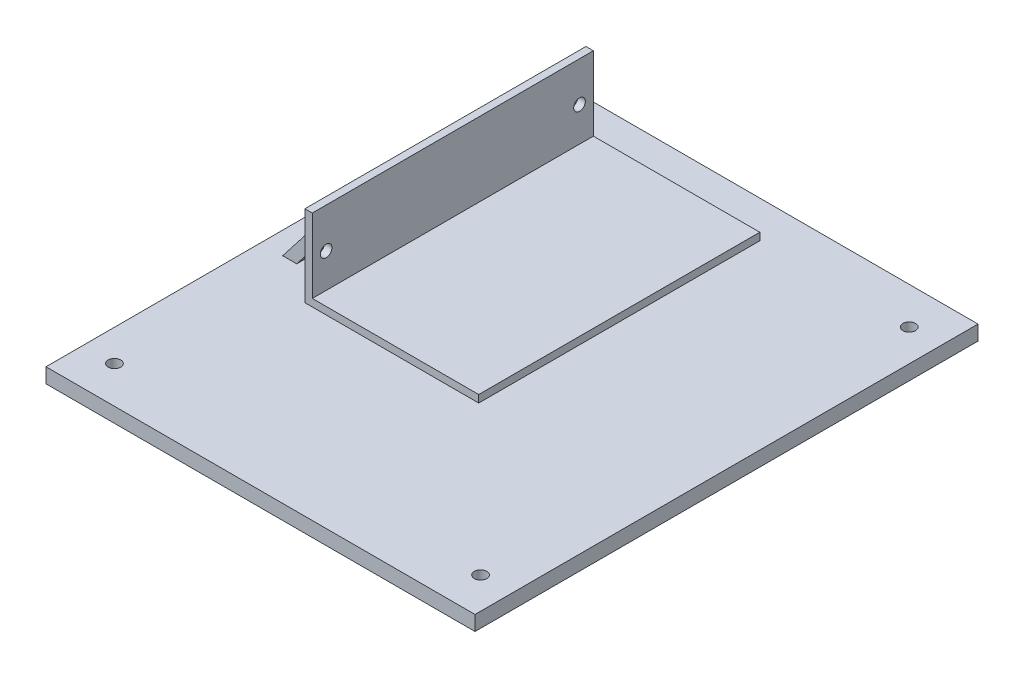
ISO-10303-21;
HEADER;
FILE_DESCRIPTION(('STEP AP214'),'2;1');
FILE_NAME('part.step','',(''),(''),'','','');
FILE_SCHEMA(('AUTOMOTIVE_DESIGN { 1 0 10303 214 1 1 1 1 }'));
ENDSEC;
DATA;
#1=APPLICATION_CONTEXT('core data for automotive mechanical design processes');
#2=APPLICATION_PROTOCOL_DEFINITION('international standard','automotive_design',2000,#1);
#3=PRODUCT_CONTEXT('',#1,'mechanical');
#4=PRODUCT('Part','Part','',(#3));
#5=PRODUCT_RELATED_PRODUCT_CATEGORY('part','',(#4));
#6=PRODUCT_DEFINITION_FORMATION('','',#4);
#7=PRODUCT_DEFINITION_CONTEXT('part definition',#1,'design');
#8=PRODUCT_DEFINITION('design','',#6,#7);
#9=PRODUCT_DEFINITION_SHAPE('','',#8);
#10=(LENGTH_UNIT() NAMED_UNIT(*) SI_UNIT(.MILLI.,.METRE.));
#11=(NAMED_UNIT(*) PLANE_ANGLE_UNIT() SI_UNIT($,.RADIAN.));
#12=(NAMED_UNIT(*) SI_UNIT($,.STERADIAN.) SOLID_ANGLE_UNIT());
#13=UNCERTAINTY_MEASURE_WITH_UNIT(LENGTH_MEASURE(1.E-05),#10,'distance_accuracy_value','');
#14=(GEOMETRIC_REPRESENTATION_CONTEXT(3) GLOBAL_UNCERTAINTY_ASSIGNED_CONTEXT((#13)) GLOBAL_UNIT_ASSIGNED_CONTEXT((#10,
#11,#12)) REPRESENTATION_CONTEXT('',''));
#15=CARTESIAN_POINT('',(0.,0.,0.));
#16=DIRECTION('',(0.,0.,1.));
#17=DIRECTION('',(1.,0.,0.));
#18=AXIS2_PLACEMENT_3D('',#15,#16,#17);
#19=CARTESIAN_POINT('',(-73.66,2.54,172.72));
#20=DIRECTION('',(0.,-1.,0.));
#21=DIRECTION('',(0.,0.,-1.));
#22=AXIS2_PLACEMENT_3D('',#19,#20,#21);
#23=PLANE('',#22);
#24=CARTESIAN_POINT('',(-62.738,2.54,12.7));
#25=DIRECTION('',(0.,1.,0.));
#26=DIRECTION('',(0.,0.,1.));
#27=AXIS2_PLACEMENT_3D('',#24,#25,#26);
#28=CIRCLE('',#27,2.159);
#29=CARTESIAN_POINT('',(-62.738,2.54,14.859));
#30=VERTEX_POINT('',#29);
#31=EDGE_CURVE('E230',#30,#30,#28,.T.);
#32=ORIENTED_EDGE('',*,*,#31,.F.);
#33=EDGE_LOOP('',(#32));
#34=FACE_BOUND('',#33,.T.);
#35=DIRECTION('',(-1.,0.,0.));
#36=VECTOR('',#35,1.);
#37=CARTESIAN_POINT('',(-73.66,2.54,0.));
#38=LINE('',#37,#36);
#39=CARTESIAN_POINT('',(73.66,2.54,0.));
#40=VERTEX_POINT('',#39);
#41=CARTESIAN_POINT('',(-73.66,2.54,0.));
#42=VERTEX_POINT('',#41);
#43=EDGE_CURVE('E254',#40,#42,#38,.T.);
#44=ORIENTED_EDGE('',*,*,#43,.T.);
#45=DIRECTION('',(0.,0.,-1.));
#46=VECTOR('',#45,1.);
#47=CARTESIAN_POINT('',(-73.66,2.54,172.72));
#48=LINE('',#47,#46);
#49=CARTESIAN_POINT('',(-73.66,2.54,172.72));
#50=VERTEX_POINT('',#49);
#51=EDGE_CURVE('E48',#50,#42,#48,.T.);
#52=ORIENTED_EDGE('',*,*,#51,.F.);
#53=DIRECTION('',(-1.,0.,0.));
#54=VECTOR('',#53,1.);
#55=CARTESIAN_POINT('',(-73.66,2.54,172.72));
#56=LINE('',#55,#54);
#57=CARTESIAN_POINT('',(73.66,2.54,172.72));
#58=VERTEX_POINT('',#57);
#59=EDGE_CURVE('E244',#58,#50,#56,.T.);
#60=ORIENTED_EDGE('',*,*,#59,.F.);
#61=DIRECTION('',(0.,0.,-1.));
#62=VECTOR('',#61,1.);
#63=CARTESIAN_POINT('',(73.66,2.54,172.72));
#64=LINE('',#63,#62);
#65=EDGE_CURVE('E11',#58,#40,#64,.T.);
#66=ORIENTED_EDGE('',*,*,#65,.T.);
#67=EDGE_LOOP('',(#44,#52,#60,#66));
#68=FACE_BOUND('',#67,.T.);
#69=DIRECTION('',(0.,0.,1.));
#70=VECTOR('',#69,1.);
#71=CARTESIAN_POINT('',(-48.26,2.54,12.7));
#72=LINE('',#71,#70);
#73=CARTESIAN_POINT('',(-48.26,2.54,12.7));
#74=VERTEX_POINT('',#73);
#75=CARTESIAN_POINT('',(-48.26,2.54,109.22));
#76=VERTEX_POINT('',#75);
#77=EDGE_CURVE('E188',#74,#76,#72,.T.);
#78=ORIENTED_EDGE('',*,*,#77,.F.);
#79=DIRECTION('',(-1.,0.,0.));
#80=VECTOR('',#79,1.);
#81=CARTESIAN_POINT('',(-48.26,2.54,12.7));
#82=LINE('',#81,#80);
#83=CARTESIAN_POINT('',(11.43,2.54,12.7));
#84=VERTEX_POINT('',#83);
#85=EDGE_CURVE('E192',#84,#74,#82,.T.);
#86=ORIENTED_EDGE('',*,*,#85,.F.);
#87=DIRECTION('',(0.,0.,-1.));
#88=VECTOR('',#87,1.);
#89=CARTESIAN_POINT('',(11.43,2.54,12.7));
#90=LINE('',#89,#88);
#91=CARTESIAN_POINT('',(11.43,2.54,109.22));
#92=VERTEX_POINT('',#91);
#93=EDGE_CURVE('E201',#92,#84,#90,.T.);
#94=ORIENTED_EDGE('',*,*,#93,.F.);
#95=DIRECTION('',(1.,0.,0.));
#96=VECTOR('',#95,1.);
#97=CARTESIAN_POINT('',(-48.26,2.54,109.22));
#98=LINE('',#97,#96);
#99=EDGE_CURVE('E198',#76,#92,#98,.T.);
#100=ORIENTED_EDGE('',*,*,#99,.F.);
#101=EDGE_LOOP('',(#78,#86,#94,#100));
#102=FACE_BOUND('',#101,.T.);
#103=CARTESIAN_POINT('',(62.865,2.54,160.02));
#104=DIRECTION('',(0.,1.,0.));
#105=DIRECTION('',(0.,0.,1.));
#106=AXIS2_PLACEMENT_3D('',#103,#104,#105);
#107=CIRCLE('',#106,2.15899999999999);
#108=CARTESIAN_POINT('',(62.865,2.54,162.179));
#109=VERTEX_POINT('',#108);
#110=EDGE_CURVE('E224',#109,#109,#107,.T.);
#111=ORIENTED_EDGE('',*,*,#110,.F.);
#112=EDGE_LOOP('',(#111));
#113=FACE_BOUND('',#112,.T.);
#114=CARTESIAN_POINT('',(-62.865,2.54,160.02));
#115=DIRECTION('',(0.,1.,0.));
#116=DIRECTION('',(0.,0.,1.));
#117=AXIS2_PLACEMENT_3D('',#114,#115,#116);
#118=CIRCLE('',#117,2.15899999999999);
#119=CARTESIAN_POINT('',(-62.865,2.54,162.179));
#120=VERTEX_POINT('',#119);
#121=EDGE_CURVE('E217',#120,#120,#118,.T.);
#122=ORIENTED_EDGE('',*,*,#121,.F.);
#123=EDGE_LOOP('',(#122));
#124=FACE_BOUND('',#123,.T.);
#125=CARTESIAN_POINT('',(62.738,2.54,12.7));
#126=DIRECTION('',(0.,1.,0.));
#127=DIRECTION('',(0.,0.,1.));
#128=AXIS2_PLACEMENT_3D('',#125,#126,#127);
#129=CIRCLE('',#128,2.15899999999999);
#130=CARTESIAN_POINT('',(62.738,2.54,14.859));
#131=VERTEX_POINT('',#130);
#132=EDGE_CURVE('E220',#131,#131,#129,.T.);
#133=ORIENTED_EDGE('',*,*,#132,.F.);
#134=EDGE_LOOP('',(#133));
#135=FACE_BOUND('',#134,.T.);
#136=DIRECTION('',(1.,0.,0.));
#137=VECTOR('',#136,1.);
#138=CARTESIAN_POINT('',(-66.04,2.54,22.86));
#139=LINE('',#138,#137);
#140=CARTESIAN_POINT('',(-66.04,2.54,22.86));
#141=VERTEX_POINT('',#140);
#142=CARTESIAN_POINT('',(-61.2132573670803,2.54,22.86));
#143=VERTEX_POINT('',#142);
#144=EDGE_CURVE('E147',#141,#143,#139,.T.);
#145=ORIENTED_EDGE('',*,*,#144,.T.);
#146=DIRECTION('',(0.,0.,1.));
#147=VECTOR('',#146,1.);
#148=CARTESIAN_POINT('',(-61.2132573670803,2.54,0.));
#149=LINE('',#148,#147);
#150=CARTESIAN_POINT('',(-61.2132573670803,2.54,99.06));
#151=VERTEX_POINT('',#150);
#152=EDGE_CURVE('E142',#143,#151,#149,.T.);
#153=ORIENTED_EDGE('',*,*,#152,.T.);
#154=DIRECTION('',(1.,0.,0.));
#155=VECTOR('',#154,1.);
#156=CARTESIAN_POINT('',(-66.04,2.54,99.06));
#157=LINE('',#156,#155);
#158=CARTESIAN_POINT('',(-66.04,2.54,99.06));
#159=VERTEX_POINT('',#158);
#160=EDGE_CURVE('E145',#159,#151,#157,.T.);
#161=ORIENTED_EDGE('',*,*,#160,.F.);
#162=DIRECTION('',(0.,0.,1.));
#163=VECTOR('',#162,1.);
#164=CARTESIAN_POINT('',(-66.04,2.54,22.86));
#165=LINE('',#164,#163);
#166=EDGE_CURVE('E161',#141,#159,#165,.T.);
#167=ORIENTED_EDGE('',*,*,#166,.F.);
#168=EDGE_LOOP('',(#145,#153,#161,#167));
#169=FACE_BOUND('',#168,.T.);
#170=ADVANCED_FACE('F40',(#34,#68,#102,#113,#124,#135,#169),#23,.F.);
#171=CARTESIAN_POINT('',(-48.26,5.08,12.7));
#172=DIRECTION('',(1.,0.,0.));
#173=DIRECTION('',(0.,0.,-1.));
#174=AXIS2_PLACEMENT_3D('',#171,#172,#173);
#175=PLANE('',#174);
#176=CARTESIAN_POINT('',(-48.26,16.83,104.46));
#177=DIRECTION('',(1.,0.,0.));
#178=DIRECTION('',(0.,0.,-1.));
#179=AXIS2_PLACEMENT_3D('',#176,#177,#178);
#180=CIRCLE('',#179,2.);
#181=CARTESIAN_POINT('',(-48.26,16.83,102.46));
#182=VERTEX_POINT('',#181);
#183=EDGE_CURVE('E150',#182,#182,#180,.T.);
#184=ORIENTED_EDGE('',*,*,#183,.T.);
#185=EDGE_LOOP('',(#184));
#186=FACE_BOUND('',#185,.T.);
#187=CARTESIAN_POINT('',(-48.26,16.83,17.46));
#188=DIRECTION('',(1.,0.,0.));
#189=DIRECTION('',(0.,0.,-1.));
#190=AXIS2_PLACEMENT_3D('',#187,#188,#189);
#191=CIRCLE('',#190,2.);
#192=CARTESIAN_POINT('',(-48.26,16.83,15.46));
#193=VERTEX_POINT('',#192);
#194=EDGE_CURVE('E418',#193,#193,#191,.T.);
#195=ORIENTED_EDGE('',*,*,#194,.T.);
#196=EDGE_LOOP('',(#195));
#197=FACE_BOUND('',#196,.T.);
#198=DIRECTION('',(0.,0.,1.));
#199=VECTOR('',#198,1.);
#200=CARTESIAN_POINT('',(-48.26,19.194188043389,0.));
#201=LINE('',#200,#199);
#202=CARTESIAN_POINT('',(-48.26,19.194188043389,22.86));
#203=VERTEX_POINT('',#202);
#204=CARTESIAN_POINT('',(-48.26,19.194188043389,99.06));
#205=VERTEX_POINT('',#204);
#206=EDGE_CURVE('E55',#203,#205,#201,.T.);
#207=ORIENTED_EDGE('',*,*,#206,.F.);
#208=DIRECTION('',(0.,-1.,0.));
#209=VECTOR('',#208,1.);
#210=CARTESIAN_POINT('',(-48.26,2.54,22.86));
#211=LINE('',#210,#209);
#212=CARTESIAN_POINT('',(-48.26,25.4,22.86));
#213=VERTEX_POINT('',#212);
#214=EDGE_CURVE('E428',#213,#203,#211,.T.);
#215=ORIENTED_EDGE('',*,*,#214,.F.);
#216=DIRECTION('',(0.,0.,-1.));
#217=VECTOR('',#216,1.);
#218=CARTESIAN_POINT('',(-48.26,25.4,22.86));
#219=LINE('',#218,#217);
#220=CARTESIAN_POINT('',(-48.26,25.4,99.06));
#221=VERTEX_POINT('',#220);
#222=EDGE_CURVE('E165',#221,#213,#219,.T.);
#223=ORIENTED_EDGE('',*,*,#222,.F.);
#224=DIRECTION('',(0.,1.,0.));
#225=VECTOR('',#224,1.);
#226=CARTESIAN_POINT('',(-48.26,2.54,99.06));
#227=LINE('',#226,#225);
#228=EDGE_CURVE('E431',#205,#221,#227,.T.);
#229=ORIENTED_EDGE('',*,*,#228,.F.);
#230=EDGE_LOOP('',(#207,#215,#223,#229));
#231=FACE_BOUND('',#230,.T.);
#232=DIRECTION('',(0.,-1.,0.));
#233=VECTOR('',#232,1.);
#234=CARTESIAN_POINT('',(-48.26,5.08,12.7));
#235=LINE('',#234,#233);
#236=CARTESIAN_POINT('',(-48.26,30.48,12.7));
#237=VERTEX_POINT('',#236);
#238=EDGE_CURVE('E196',#237,#74,#235,.T.);
#239=ORIENTED_EDGE('',*,*,#238,.T.);
#240=ORIENTED_EDGE('',*,*,#77,.T.);
#241=DIRECTION('',(0.,-1.,0.));
#242=VECTOR('',#241,1.);
#243=CARTESIAN_POINT('',(-48.26,5.08,109.22));
#244=LINE('',#243,#242);
#245=CARTESIAN_POINT('',(-48.26,30.48,109.22));
#246=VERTEX_POINT('',#245);
#247=EDGE_CURVE('E213',#246,#76,#244,.T.);
#248=ORIENTED_EDGE('',*,*,#247,.F.);
#249=DIRECTION('',(0.,0.,1.));
#250=VECTOR('',#249,1.);
#251=CARTESIAN_POINT('',(-48.26,30.48,12.7));
#252=LINE('',#251,#250);
#253=EDGE_CURVE('E170',#237,#246,#252,.T.);
#254=ORIENTED_EDGE('',*,*,#253,.F.);
#255=EDGE_LOOP('',(#239,#240,#248,#254));
#256=FACE_BOUND('',#255,.T.);
#257=ADVANCED_FACE('F286',(#186,#197,#231,#256),#175,.F.);
#258=CARTESIAN_POINT('',(73.66,-2.54,172.72));
#259=DIRECTION('',(-1.,0.,0.));
#260=DIRECTION('',(0.,0.,1.));
#261=AXIS2_PLACEMENT_3D('',#258,#259,#260);
#262=PLANE('',#261);
#263=DIRECTION('',(0.,1.,0.));
#264=VECTOR('',#263,1.);
#265=CARTESIAN_POINT('',(73.66,-2.54,0.));
#266=LINE('',#265,#264);
#267=CARTESIAN_POINT('',(73.66,-2.54,0.));
#268=VERTEX_POINT('',#267);
#269=EDGE_CURVE('E238',#268,#40,#266,.T.);
#270=ORIENTED_EDGE('',*,*,#269,.T.);
#271=ORIENTED_EDGE('',*,*,#65,.F.);
#272=DIRECTION('',(0.,1.,0.));
#273=VECTOR('',#272,1.);
#274=CARTESIAN_POINT('',(73.66,-2.54,172.72));
#275=LINE('',#274,#273);
#276=CARTESIAN_POINT('',(73.66,-2.54,172.72));
#277=VERTEX_POINT('',#276);
#278=EDGE_CURVE('E241',#277,#58,#275,.T.);
#279=ORIENTED_EDGE('',*,*,#278,.F.);
#280=DIRECTION('',(0.,0.,-1.));
#281=VECTOR('',#280,1.);
#282=CARTESIAN_POINT('',(73.66,-2.54,172.72));
#283=LINE('',#282,#281);
#284=EDGE_CURVE('E251',#277,#268,#283,.T.);
#285=ORIENTED_EDGE('',*,*,#284,.T.);
#286=EDGE_LOOP('',(#270,#271,#279,#285));
#287=FACE_BOUND('',#286,.T.);
#288=ADVANCED_FACE('F42',(#287),#262,.F.);
#289=CARTESIAN_POINT('',(-73.66,-2.54,172.72));
#290=DIRECTION('',(1.,0.,0.));
#291=DIRECTION('',(0.,0.,-1.));
#292=AXIS2_PLACEMENT_3D('',#289,#290,#291);
#293=PLANE('',#292);
#294=DIRECTION('',(0.,-1.,0.));
#295=VECTOR('',#294,1.);
#296=CARTESIAN_POINT('',(-73.66,-2.54,0.));
#297=LINE('',#296,#295);
#298=CARTESIAN_POINT('',(-73.66,-2.54,0.));
#299=VERTEX_POINT('',#298);
#300=EDGE_CURVE('E256',#42,#299,#297,.T.);
#301=ORIENTED_EDGE('',*,*,#300,.T.);
#302=DIRECTION('',(0.,0.,-1.));
#303=VECTOR('',#302,1.);
#304=CARTESIAN_POINT('',(-73.66,-2.54,172.72));
#305=LINE('',#304,#303);
#306=CARTESIAN_POINT('',(-73.66,-2.54,172.72));
#307=VERTEX_POINT('',#306);
#308=EDGE_CURVE('E261',#307,#299,#305,.T.);
#309=ORIENTED_EDGE('',*,*,#308,.F.);
#310=DIRECTION('',(0.,-1.,0.));
#311=VECTOR('',#310,1.);
#312=CARTESIAN_POINT('',(-73.66,-2.54,172.72));
#313=LINE('',#312,#311);
#314=EDGE_CURVE('E247',#50,#307,#313,.T.);
#315=ORIENTED_EDGE('',*,*,#314,.F.);
#316=ORIENTED_EDGE('',*,*,#51,.T.);
#317=EDGE_LOOP('',(#301,#309,#315,#316));
#318=FACE_BOUND('',#317,.T.);
#319=ADVANCED_FACE('F268',(#318),#293,.F.);
#320=CARTESIAN_POINT('',(-73.66,-2.54,172.72));
#321=DIRECTION('',(0.,1.,0.));
#322=DIRECTION('',(0.,0.,1.));
#323=AXIS2_PLACEMENT_3D('',#320,#321,#322);
#324=PLANE('',#323);
#325=CARTESIAN_POINT('',(-62.738,-2.54,12.7));
#326=DIRECTION('',(0.,1.,0.));
#327=DIRECTION('',(0.,0.,1.));
#328=AXIS2_PLACEMENT_3D('',#325,#326,#327);
#329=CIRCLE('',#328,2.159);
#330=CARTESIAN_POINT('',(-62.738,-2.54,14.859));
#331=VERTEX_POINT('',#330);
#332=EDGE_CURVE('E216',#331,#331,#329,.T.);
#333=ORIENTED_EDGE('',*,*,#332,.T.);
#334=EDGE_LOOP('',(#333));
#335=FACE_BOUND('',#334,.T.);
#336=CARTESIAN_POINT('',(62.865,-2.54,160.02));
#337=DIRECTION('',(0.,1.,0.));
#338=DIRECTION('',(0.,0.,1.));
#339=AXIS2_PLACEMENT_3D('',#336,#337,#338);
#340=CIRCLE('',#339,2.15899999999999);
#341=CARTESIAN_POINT('',(62.865,-2.54,162.179));
#342=VERTEX_POINT('',#341);
#343=EDGE_CURVE('E227',#342,#342,#340,.T.);
#344=ORIENTED_EDGE('',*,*,#343,.T.);
#345=EDGE_LOOP('',(#344));
#346=FACE_BOUND('',#345,.T.);
#347=CARTESIAN_POINT('',(-62.865,-2.54,160.02));
#348=DIRECTION('',(0.,1.,0.));
#349=DIRECTION('',(0.,0.,1.));
#350=AXIS2_PLACEMENT_3D('',#347,#348,#349);
#351=CIRCLE('',#350,2.15899999999999);
#352=CARTESIAN_POINT('',(-62.865,-2.54,162.179));
#353=VERTEX_POINT('',#352);
#354=EDGE_CURVE('E221',#353,#353,#351,.T.);
#355=ORIENTED_EDGE('',*,*,#354,.T.);
#356=EDGE_LOOP('',(#355));
#357=FACE_BOUND('',#356,.T.);
#358=CARTESIAN_POINT('',(62.738,-2.54,12.7));
#359=DIRECTION('',(0.,1.,0.));
#360=DIRECTION('',(0.,0.,1.));
#361=AXIS2_PLACEMENT_3D('',#358,#359,#360);
#362=CIRCLE('',#361,2.15899999999999);
#363=CARTESIAN_POINT('',(62.738,-2.54,14.859));
#364=VERTEX_POINT('',#363);
#365=EDGE_CURVE('E235',#364,#364,#362,.T.);
#366=ORIENTED_EDGE('',*,*,#365,.T.);
#367=EDGE_LOOP('',(#366));
#368=FACE_BOUND('',#367,.T.);
#369=DIRECTION('',(1.,0.,0.));
#370=VECTOR('',#369,1.);
#371=CARTESIAN_POINT('',(-73.66,-2.54,0.));
#372=LINE('',#371,#370);
#373=EDGE_CURVE('E245',#299,#268,#372,.T.);
#374=ORIENTED_EDGE('',*,*,#373,.T.);
#375=ORIENTED_EDGE('',*,*,#284,.F.);
#376=DIRECTION('',(1.,0.,0.));
#377=VECTOR('',#376,1.);
#378=CARTESIAN_POINT('',(-73.66,-2.54,172.72));
#379=LINE('',#378,#377);
#380=EDGE_CURVE('E249',#307,#277,#379,.T.);
#381=ORIENTED_EDGE('',*,*,#380,.F.);
#382=ORIENTED_EDGE('',*,*,#308,.T.);
#383=EDGE_LOOP('',(#374,#375,#381,#382));
#384=FACE_BOUND('',#383,.T.);
#385=ADVANCED_FACE('F277',(#335,#346,#357,#368,#384),#324,.F.);
#386=CARTESIAN_POINT('',(0.,0.,172.72));
#387=DIRECTION('',(0.,0.,-1.));
#388=DIRECTION('',(-1.,0.,0.));
#389=AXIS2_PLACEMENT_3D('',#386,#387,#388);
#390=PLANE('',#389);
#391=ORIENTED_EDGE('',*,*,#278,.T.);
#392=ORIENTED_EDGE('',*,*,#59,.T.);
#393=ORIENTED_EDGE('',*,*,#314,.T.);
#394=ORIENTED_EDGE('',*,*,#380,.T.);
#395=EDGE_LOOP('',(#391,#392,#393,#394));
#396=FACE_BOUND('',#395,.T.);
#397=ADVANCED_FACE('F283',(#396),#390,.F.);
#398=CARTESIAN_POINT('',(0.,0.,0.));
#399=DIRECTION('',(0.,0.,-1.));
#400=DIRECTION('',(-1.,0.,0.));
#401=AXIS2_PLACEMENT_3D('',#398,#399,#400);
#402=PLANE('',#401);
#403=ORIENTED_EDGE('',*,*,#269,.F.);
#404=ORIENTED_EDGE('',*,*,#373,.F.);
#405=ORIENTED_EDGE('',*,*,#300,.F.);
#406=ORIENTED_EDGE('',*,*,#43,.F.);
#407=EDGE_LOOP('',(#403,#404,#405,#406));
#408=FACE_BOUND('',#407,.T.);
#409=ADVANCED_FACE('F274',(#408),#402,.T.);
#410=CARTESIAN_POINT('',(62.738,-2.54,12.7));
#411=DIRECTION('',(0.,1.,0.));
#412=DIRECTION('',(0.,0.,1.));
#413=AXIS2_PLACEMENT_3D('',#410,#411,#412);
#414=CYLINDRICAL_SURFACE('',#413,2.15899999999999);
#415=ORIENTED_EDGE('',*,*,#365,.F.);
#416=EDGE_LOOP('',(#415));
#417=FACE_BOUND('',#416,.T.);
#418=ORIENTED_EDGE('',*,*,#132,.T.);
#419=EDGE_LOOP('',(#418));
#420=FACE_BOUND('',#419,.T.);
#421=ADVANCED_FACE('F297',(#417,#420),#414,.F.);
#422=CARTESIAN_POINT('',(-62.865,-2.54,160.02));
#423=DIRECTION('',(0.,1.,0.));
#424=DIRECTION('',(0.,0.,1.));
#425=AXIS2_PLACEMENT_3D('',#422,#423,#424);
#426=CYLINDRICAL_SURFACE('',#425,2.15899999999999);
#427=ORIENTED_EDGE('',*,*,#354,.F.);
#428=EDGE_LOOP('',(#427));
#429=FACE_BOUND('',#428,.T.);
#430=ORIENTED_EDGE('',*,*,#121,.T.);
#431=EDGE_LOOP('',(#430));
#432=FACE_BOUND('',#431,.T.);
#433=ADVANCED_FACE('F299',(#429,#432),#426,.F.);
#434=CARTESIAN_POINT('',(62.865,-2.54,160.02));
#435=DIRECTION('',(0.,1.,0.));
#436=DIRECTION('',(0.,0.,1.));
#437=AXIS2_PLACEMENT_3D('',#434,#435,#436);
#438=CYLINDRICAL_SURFACE('',#437,2.15899999999999);
#439=ORIENTED_EDGE('',*,*,#343,.F.);
#440=EDGE_LOOP('',(#439));
#441=FACE_BOUND('',#440,.T.);
#442=ORIENTED_EDGE('',*,*,#110,.T.);
#443=EDGE_LOOP('',(#442));
#444=FACE_BOUND('',#443,.T.);
#445=ADVANCED_FACE('F306',(#441,#444),#438,.F.);
#446=CARTESIAN_POINT('',(-62.738,-2.54,12.7));
#447=DIRECTION('',(0.,1.,0.));
#448=DIRECTION('',(0.,0.,1.));
#449=AXIS2_PLACEMENT_3D('',#446,#447,#448);
#450=CYLINDRICAL_SURFACE('',#449,2.159);
#451=ORIENTED_EDGE('',*,*,#332,.F.);
#452=EDGE_LOOP('',(#451));
#453=FACE_BOUND('',#452,.T.);
#454=ORIENTED_EDGE('',*,*,#31,.T.);
#455=EDGE_LOOP('',(#454));
#456=FACE_BOUND('',#455,.T.);
#457=ADVANCED_FACE('F313',(#453,#456),#450,.F.);
#458=CARTESIAN_POINT('',(-48.26,5.08,109.22));
#459=DIRECTION('',(0.,0.,-1.));
#460=DIRECTION('',(-1.,0.,0.));
#461=AXIS2_PLACEMENT_3D('',#458,#459,#460);
#462=PLANE('',#461);
#463=ORIENTED_EDGE('',*,*,#99,.T.);
#464=DIRECTION('',(0.,-1.,0.));
#465=VECTOR('',#464,1.);
#466=CARTESIAN_POINT('',(11.43,5.08,109.22));
#467=LINE('',#466,#465);
#468=CARTESIAN_POINT('',(11.43,5.08,109.22));
#469=VERTEX_POINT('',#468);
#470=EDGE_CURVE('E210',#469,#92,#467,.T.);
#471=ORIENTED_EDGE('',*,*,#470,.F.);
#472=DIRECTION('',(1.,0.,0.));
#473=VECTOR('',#472,1.);
#474=CARTESIAN_POINT('',(-48.26,5.08,109.22));
#475=LINE('',#474,#473);
#476=CARTESIAN_POINT('',(-45.72,5.08,109.22));
#477=VERTEX_POINT('',#476);
#478=EDGE_CURVE('E189',#477,#469,#475,.T.);
#479=ORIENTED_EDGE('',*,*,#478,.F.);
#480=DIRECTION('',(0.,-1.,0.));
#481=VECTOR('',#480,1.);
#482=CARTESIAN_POINT('',(-45.72,30.48,109.22));
#483=LINE('',#482,#481);
#484=CARTESIAN_POINT('',(-45.72,30.48,109.22));
#485=VERTEX_POINT('',#484);
#486=EDGE_CURVE('E185',#485,#477,#483,.T.);
#487=ORIENTED_EDGE('',*,*,#486,.F.);
#488=DIRECTION('',(1.,0.,0.));
#489=VECTOR('',#488,1.);
#490=CARTESIAN_POINT('',(-48.26,30.48,109.22));
#491=LINE('',#490,#489);
#492=EDGE_CURVE('E173',#246,#485,#491,.T.);
#493=ORIENTED_EDGE('',*,*,#492,.F.);
#494=ORIENTED_EDGE('',*,*,#247,.T.);
#495=EDGE_LOOP('',(#463,#471,#479,#487,#493,#494));
#496=FACE_BOUND('',#495,.T.);
#497=ADVANCED_FACE('F334',(#496),#462,.F.);
#498=CARTESIAN_POINT('',(11.43,5.08,12.7));
#499=DIRECTION('',(-1.,0.,0.));
#500=DIRECTION('',(0.,0.,1.));
#501=AXIS2_PLACEMENT_3D('',#498,#499,#500);
#502=PLANE('',#501);
#503=ORIENTED_EDGE('',*,*,#93,.T.);
#504=DIRECTION('',(0.,-1.,0.));
#505=VECTOR('',#504,1.);
#506=CARTESIAN_POINT('',(11.43,5.08,12.7));
#507=LINE('',#506,#505);
#508=CARTESIAN_POINT('',(11.43,5.08,12.7));
#509=VERTEX_POINT('',#508);
#510=EDGE_CURVE('E207',#509,#84,#507,.T.);
#511=ORIENTED_EDGE('',*,*,#510,.F.);
#512=DIRECTION('',(0.,0.,-1.));
#513=VECTOR('',#512,1.);
#514=CARTESIAN_POINT('',(11.43,5.08,12.7));
#515=LINE('',#514,#513);
#516=EDGE_CURVE('E191',#469,#509,#515,.T.);
#517=ORIENTED_EDGE('',*,*,#516,.F.);
#518=ORIENTED_EDGE('',*,*,#470,.T.);
#519=EDGE_LOOP('',(#503,#511,#517,#518));
#520=FACE_BOUND('',#519,.T.);
#521=ADVANCED_FACE('F352',(#520),#502,.F.);
#522=CARTESIAN_POINT('',(-48.26,5.08,12.7));
#523=DIRECTION('',(0.,0.,1.));
#524=DIRECTION('',(1.,0.,0.));
#525=AXIS2_PLACEMENT_3D('',#522,#523,#524);
#526=PLANE('',#525);
#527=ORIENTED_EDGE('',*,*,#85,.T.);
#528=ORIENTED_EDGE('',*,*,#238,.F.);
#529=DIRECTION('',(-1.,0.,0.));
#530=VECTOR('',#529,1.);
#531=CARTESIAN_POINT('',(-48.26,30.48,12.7));
#532=LINE('',#531,#530);
#533=CARTESIAN_POINT('',(-45.72,30.48,12.7));
#534=VERTEX_POINT('',#533);
#535=EDGE_CURVE('E177',#534,#237,#532,.T.);
#536=ORIENTED_EDGE('',*,*,#535,.F.);
#537=DIRECTION('',(0.,-1.,0.));
#538=VECTOR('',#537,1.);
#539=CARTESIAN_POINT('',(-45.72,30.48,12.7));
#540=LINE('',#539,#538);
#541=CARTESIAN_POINT('',(-45.72,5.08,12.7));
#542=VERTEX_POINT('',#541);
#543=EDGE_CURVE('E180',#534,#542,#540,.T.);
#544=ORIENTED_EDGE('',*,*,#543,.T.);
#545=DIRECTION('',(-1.,0.,0.));
#546=VECTOR('',#545,1.);
#547=CARTESIAN_POINT('',(-48.26,5.08,12.7));
#548=LINE('',#547,#546);
#549=EDGE_CURVE('E194',#509,#542,#548,.T.);
#550=ORIENTED_EDGE('',*,*,#549,.F.);
#551=ORIENTED_EDGE('',*,*,#510,.T.);
#552=EDGE_LOOP('',(#527,#528,#536,#544,#550,#551));
#553=FACE_BOUND('',#552,.T.);
#554=ADVANCED_FACE('F360',(#553),#526,.F.);
#555=CARTESIAN_POINT('',(0.,5.08,0.));
#556=DIRECTION('',(0.,1.,0.));
#557=DIRECTION('',(0.,0.,1.));
#558=AXIS2_PLACEMENT_3D('',#555,#556,#557);
#559=PLANE('',#558);
#560=DIRECTION('',(0.,0.,-1.));
#561=VECTOR('',#560,1.);
#562=CARTESIAN_POINT('',(-45.72,5.08,12.7));
#563=LINE('',#562,#561);
#564=EDGE_CURVE('E163',#477,#542,#563,.T.);
#565=ORIENTED_EDGE('',*,*,#564,.F.);
#566=ORIENTED_EDGE('',*,*,#478,.T.);
#567=ORIENTED_EDGE('',*,*,#516,.T.);
#568=ORIENTED_EDGE('',*,*,#549,.T.);
#569=EDGE_LOOP('',(#565,#566,#567,#568));
#570=FACE_BOUND('',#569,.T.);
#571=ADVANCED_FACE('F369',(#570),#559,.T.);
#572=CARTESIAN_POINT('',(-45.72,30.48,12.7));
#573=DIRECTION('',(-1.,0.,0.));
#574=DIRECTION('',(0.,0.,1.));
#575=AXIS2_PLACEMENT_3D('',#572,#573,#574);
#576=PLANE('',#575);
#577=CARTESIAN_POINT('',(-45.72,16.83,104.46));
#578=DIRECTION('',(1.,0.,0.));
#579=DIRECTION('',(0.,0.,-1.));
#580=AXIS2_PLACEMENT_3D('',#577,#578,#579);
#581=CIRCLE('',#580,2.);
#582=CARTESIAN_POINT('',(-45.72,16.83,102.46));
#583=VERTEX_POINT('',#582);
#584=EDGE_CURVE('E416',#583,#583,#581,.T.);
#585=ORIENTED_EDGE('',*,*,#584,.F.);
#586=EDGE_LOOP('',(#585));
#587=FACE_BOUND('',#586,.T.);
#588=CARTESIAN_POINT('',(-45.72,16.83,17.46));
#589=DIRECTION('',(1.,0.,0.));
#590=DIRECTION('',(0.,0.,-1.));
#591=AXIS2_PLACEMENT_3D('',#588,#589,#590);
#592=CIRCLE('',#591,2.);
#593=CARTESIAN_POINT('',(-45.72,16.83,15.46));
#594=VERTEX_POINT('',#593);
#595=EDGE_CURVE('E433',#594,#594,#592,.T.);
#596=ORIENTED_EDGE('',*,*,#595,.F.);
#597=EDGE_LOOP('',(#596));
#598=FACE_BOUND('',#597,.T.);
#599=ORIENTED_EDGE('',*,*,#564,.T.);
#600=ORIENTED_EDGE('',*,*,#543,.F.);
#601=DIRECTION('',(0.,0.,-1.));
#602=VECTOR('',#601,1.);
#603=CARTESIAN_POINT('',(-45.72,30.48,12.7));
#604=LINE('',#603,#602);
#605=EDGE_CURVE('E175',#485,#534,#604,.T.);
#606=ORIENTED_EDGE('',*,*,#605,.F.);
#607=ORIENTED_EDGE('',*,*,#486,.T.);
#608=EDGE_LOOP('',(#599,#600,#606,#607));
#609=FACE_BOUND('',#608,.T.);
#610=ADVANCED_FACE('F373',(#587,#598,#609),#576,.F.);
#611=CARTESIAN_POINT('',(0.,30.48,0.));
#612=DIRECTION('',(0.,1.,0.));
#613=DIRECTION('',(0.,0.,1.));
#614=AXIS2_PLACEMENT_3D('',#611,#612,#613);
#615=PLANE('',#614);
#616=ORIENTED_EDGE('',*,*,#253,.T.);
#617=ORIENTED_EDGE('',*,*,#492,.T.);
#618=ORIENTED_EDGE('',*,*,#605,.T.);
#619=ORIENTED_EDGE('',*,*,#535,.T.);
#620=EDGE_LOOP('',(#616,#617,#618,#619));
#621=FACE_BOUND('',#620,.T.);
#622=ADVANCED_FACE('F377',(#621),#615,.T.);
#623=CARTESIAN_POINT('',(-66.04,2.54,22.86));
#624=DIRECTION('',(0.,0.,1.));
#625=DIRECTION('',(1.,0.,0.));
#626=AXIS2_PLACEMENT_3D('',#623,#624,#625);
#627=PLANE('',#626);
#628=ORIENTED_EDGE('',*,*,#214,.T.);
#629=DIRECTION('',(-0.613940613514921,-0.789352217376326,0.));
#630=VECTOR('',#629,1.);
#631=CARTESIAN_POINT('',(-63.0325680517962,0.200886262508153,22.86));
#632=LINE('',#631,#630);
#633=EDGE_CURVE('E427',#203,#143,#632,.T.);
#634=ORIENTED_EDGE('',*,*,#633,.T.);
#635=ORIENTED_EDGE('',*,*,#144,.F.);
#636=DIRECTION('',(0.613940613514921,0.789352217376326,0.));
#637=VECTOR('',#636,1.);
#638=CARTESIAN_POINT('',(-66.04,2.54,22.86));
#639=LINE('',#638,#637);
#640=EDGE_CURVE('E63',#141,#213,#639,.T.);
#641=ORIENTED_EDGE('',*,*,#640,.T.);
#642=EDGE_LOOP('',(#628,#634,#635,#641));
#643=FACE_BOUND('',#642,.T.);
#644=ADVANCED_FACE('F393',(#643),#627,.F.);
#645=CARTESIAN_POINT('',(-66.04,2.54,99.06));
#646=DIRECTION('',(0.,0.,-1.));
#647=DIRECTION('',(-1.,0.,0.));
#648=AXIS2_PLACEMENT_3D('',#645,#646,#647);
#649=PLANE('',#648);
#650=ORIENTED_EDGE('',*,*,#160,.T.);
#651=DIRECTION('',(-0.613940613514921,-0.789352217376326,0.));
#652=VECTOR('',#651,1.);
#653=CARTESIAN_POINT('',(-61.2132573670803,2.54,99.06));
#654=LINE('',#653,#652);
#655=EDGE_CURVE('E153',#205,#151,#654,.T.);
#656=ORIENTED_EDGE('',*,*,#655,.F.);
#657=ORIENTED_EDGE('',*,*,#228,.T.);
#658=DIRECTION('',(0.613940613514921,0.789352217376326,0.));
#659=VECTOR('',#658,1.);
#660=CARTESIAN_POINT('',(-66.04,2.54,99.06));
#661=LINE('',#660,#659);
#662=EDGE_CURVE('E157',#159,#221,#661,.T.);
#663=ORIENTED_EDGE('',*,*,#662,.F.);
#664=EDGE_LOOP('',(#650,#656,#657,#663));
#665=FACE_BOUND('',#664,.T.);
#666=ADVANCED_FACE('F160',(#665),#649,.F.);
#667=CARTESIAN_POINT('',(-66.04,2.54,0.));
#668=DIRECTION('',(0.789352217376326,-0.613940613514921,0.));
#669=DIRECTION('',(0.613940613514921,0.789352217376326,0.));
#670=AXIS2_PLACEMENT_3D('',#667,#668,#669);
#671=PLANE('',#670);
#672=ORIENTED_EDGE('',*,*,#166,.T.);
#673=ORIENTED_EDGE('',*,*,#662,.T.);
#674=ORIENTED_EDGE('',*,*,#222,.T.);
#675=ORIENTED_EDGE('',*,*,#640,.F.);
#676=EDGE_LOOP('',(#672,#673,#674,#675));
#677=FACE_BOUND('',#676,.T.);
#678=ADVANCED_FACE('F399',(#677),#671,.F.);
#679=CARTESIAN_POINT('',(-61.2132573670803,2.54,0.));
#680=DIRECTION('',(-0.789352217376326,0.613940613514921,0.));
#681=DIRECTION('',(-0.613940613514921,-0.789352217376326,0.));
#682=AXIS2_PLACEMENT_3D('',#679,#680,#681);
#683=PLANE('',#682);
#684=ORIENTED_EDGE('',*,*,#206,.T.);
#685=ORIENTED_EDGE('',*,*,#655,.T.);
#686=ORIENTED_EDGE('',*,*,#152,.F.);
#687=ORIENTED_EDGE('',*,*,#633,.F.);
#688=EDGE_LOOP('',(#684,#685,#686,#687));
#689=FACE_BOUND('',#688,.T.);
#690=ADVANCED_FACE('F154',(#689),#683,.F.);
#691=CARTESIAN_POINT('',(-73.66,16.83,17.46));
#692=DIRECTION('',(1.,0.,0.));
#693=DIRECTION('',(0.,0.,-1.));
#694=AXIS2_PLACEMENT_3D('',#691,#692,#693);
#695=CYLINDRICAL_SURFACE('',#694,2.);
#696=ORIENTED_EDGE('',*,*,#595,.T.);
#697=EDGE_LOOP('',(#696));
#698=FACE_BOUND('',#697,.T.);
#699=ORIENTED_EDGE('',*,*,#194,.F.);
#700=EDGE_LOOP('',(#699));
#701=FACE_BOUND('',#700,.T.);
#702=ADVANCED_FACE('F404',(#698,#701),#695,.F.);
#703=CARTESIAN_POINT('',(-73.66,16.83,104.46));
#704=DIRECTION('',(1.,0.,0.));
#705=DIRECTION('',(0.,0.,-1.));
#706=AXIS2_PLACEMENT_3D('',#703,#704,#705);
#707=CYLINDRICAL_SURFACE('',#706,2.);
#708=ORIENTED_EDGE('',*,*,#584,.T.);
#709=EDGE_LOOP('',(#708));
#710=FACE_BOUND('',#709,.T.);
#711=ORIENTED_EDGE('',*,*,#183,.F.);
#712=EDGE_LOOP('',(#711));
#713=FACE_BOUND('',#712,.T.);
#714=ADVANCED_FACE('F407',(#710,#713),#707,.F.);
#715=CLOSED_SHELL('',(#170,#257,#288,#319,#385,#397,#409,#421,#433,#445,#457,#497,#521,#554,
#571,#610,#622,#644,#666,#678,#690,#702,#714));
#716=MANIFOLD_SOLID_BREP('B2',#715);
#717=ADVANCED_BREP_SHAPE_REPRESENTATION('',(#18,#716),#14);
#718=SHAPE_DEFINITION_REPRESENTATION(#9,#717);
ENDSEC;
END-ISO-10303-21;
